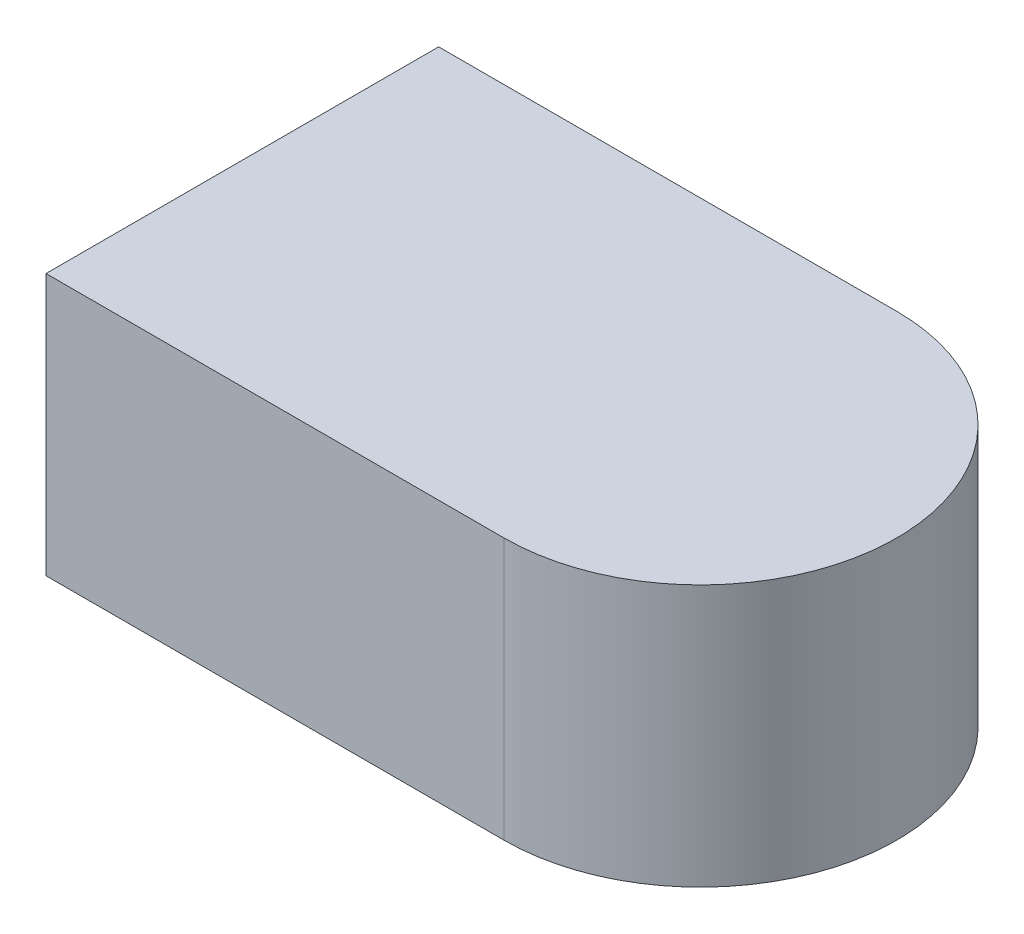
ISO-10303-21;
HEADER;
FILE_DESCRIPTION(('STEP AP214'),'2;1');
FILE_NAME('part.step','',(''),(''),'','','');
FILE_SCHEMA(('AUTOMOTIVE_DESIGN { 1 0 10303 214 1 1 1 1 }'));
ENDSEC;
DATA;
#1=APPLICATION_CONTEXT('core data for automotive mechanical design processes');
#2=APPLICATION_PROTOCOL_DEFINITION('international standard','automotive_design',2000,#1);
#3=PRODUCT_CONTEXT('',#1,'mechanical');
#4=PRODUCT('Part','Part','',(#3));
#5=PRODUCT_RELATED_PRODUCT_CATEGORY('part','',(#4));
#6=PRODUCT_DEFINITION_FORMATION('','',#4);
#7=PRODUCT_DEFINITION_CONTEXT('part definition',#1,'design');
#8=PRODUCT_DEFINITION('design','',#6,#7);
#9=PRODUCT_DEFINITION_SHAPE('','',#8);
#10=(LENGTH_UNIT() NAMED_UNIT(*) SI_UNIT(.MILLI.,.METRE.));
#11=(NAMED_UNIT(*) PLANE_ANGLE_UNIT() SI_UNIT($,.RADIAN.));
#12=(NAMED_UNIT(*) SI_UNIT($,.STERADIAN.) SOLID_ANGLE_UNIT());
#13=UNCERTAINTY_MEASURE_WITH_UNIT(LENGTH_MEASURE(1.E-05),#10,'distance_accuracy_value','');
#14=(GEOMETRIC_REPRESENTATION_CONTEXT(3) GLOBAL_UNCERTAINTY_ASSIGNED_CONTEXT((#13)) GLOBAL_UNIT_ASSIGNED_CONTEXT((#10,
#11,#12)) REPRESENTATION_CONTEXT('',''));
#15=CARTESIAN_POINT('',(0.,0.,0.));
#16=DIRECTION('',(0.,0.,1.));
#17=DIRECTION('',(1.,0.,0.));
#18=AXIS2_PLACEMENT_3D('',#15,#16,#17);
#19=CARTESIAN_POINT('',(0.175,0.2,0.));
#20=DIRECTION('',(0.,-1.,0.));
#21=DIRECTION('',(0.,0.,-1.));
#22=AXIS2_PLACEMENT_3D('',#19,#20,#21);
#23=CYLINDRICAL_SURFACE('',#22,0.15);
#24=CARTESIAN_POINT('',(0.175,0.,0.));
#25=DIRECTION('',(0.,1.,0.));
#26=DIRECTION('',(0.,0.,-1.));
#27=AXIS2_PLACEMENT_3D('',#24,#25,#26);
#28=CIRCLE('',#27,0.15);
#29=CARTESIAN_POINT('',(0.175,0.,0.15));
#30=VERTEX_POINT('',#29);
#31=CARTESIAN_POINT('',(0.175,0.,-0.15));
#32=VERTEX_POINT('',#31);
#33=EDGE_CURVE('E96',#30,#32,#28,.T.);
#34=ORIENTED_EDGE('',*,*,#33,.T.);
#35=DIRECTION('',(0.,-1.,0.));
#36=VECTOR('',#35,1.);
#37=CARTESIAN_POINT('',(0.175,0.2,-0.15));
#38=LINE('',#37,#36);
#39=CARTESIAN_POINT('',(0.175,0.2,-0.15));
#40=VERTEX_POINT('',#39);
#41=EDGE_CURVE('E11',#40,#32,#38,.T.);
#42=ORIENTED_EDGE('',*,*,#41,.F.);
#43=CARTESIAN_POINT('',(0.175,0.2,0.));
#44=DIRECTION('',(0.,1.,0.));
#45=DIRECTION('',(0.,0.,-1.));
#46=AXIS2_PLACEMENT_3D('',#43,#44,#45);
#47=CIRCLE('',#46,0.15);
#48=CARTESIAN_POINT('',(0.175,0.2,0.15));
#49=VERTEX_POINT('',#48);
#50=EDGE_CURVE('E84',#49,#40,#47,.T.);
#51=ORIENTED_EDGE('',*,*,#50,.F.);
#52=DIRECTION('',(0.,-1.,0.));
#53=VECTOR('',#52,1.);
#54=CARTESIAN_POINT('',(0.175,0.2,0.15));
#55=LINE('',#54,#53);
#56=EDGE_CURVE('E92',#49,#30,#55,.T.);
#57=ORIENTED_EDGE('',*,*,#56,.T.);
#58=EDGE_LOOP('',(#34,#42,#51,#57));
#59=FACE_BOUND('',#58,.T.);
#60=ADVANCED_FACE('F33',(#59),#23,.T.);
#61=CARTESIAN_POINT('',(-0.175,0.2,-0.15));
#62=DIRECTION('',(0.,0.,1.));
#63=DIRECTION('',(1.,0.,0.));
#64=AXIS2_PLACEMENT_3D('',#61,#62,#63);
#65=PLANE('',#64);
#66=DIRECTION('',(-1.,0.,0.));
#67=VECTOR('',#66,1.);
#68=CARTESIAN_POINT('',(-0.175,0.,-0.15));
#69=LINE('',#68,#67);
#70=CARTESIAN_POINT('',(-0.175,0.,-0.15));
#71=VERTEX_POINT('',#70);
#72=EDGE_CURVE('E88',#32,#71,#69,.T.);
#73=ORIENTED_EDGE('',*,*,#72,.T.);
#74=DIRECTION('',(0.,-1.,0.));
#75=VECTOR('',#74,1.);
#76=CARTESIAN_POINT('',(-0.175,0.2,-0.15));
#77=LINE('',#76,#75);
#78=CARTESIAN_POINT('',(-0.175,0.2,-0.15));
#79=VERTEX_POINT('',#78);
#80=EDGE_CURVE('E41',#79,#71,#77,.T.);
#81=ORIENTED_EDGE('',*,*,#80,.F.);
#82=DIRECTION('',(-1.,0.,0.));
#83=VECTOR('',#82,1.);
#84=CARTESIAN_POINT('',(-0.175,0.2,-0.15));
#85=LINE('',#84,#83);
#86=EDGE_CURVE('E79',#40,#79,#85,.T.);
#87=ORIENTED_EDGE('',*,*,#86,.F.);
#88=ORIENTED_EDGE('',*,*,#41,.T.);
#89=EDGE_LOOP('',(#73,#81,#87,#88));
#90=FACE_BOUND('',#89,.T.);
#91=ADVANCED_FACE('F87',(#90),#65,.F.);
#92=CARTESIAN_POINT('',(-0.175,0.2,0.15));
#93=DIRECTION('',(1.,0.,0.));
#94=DIRECTION('',(0.,0.,-1.));
#95=AXIS2_PLACEMENT_3D('',#92,#93,#94);
#96=PLANE('',#95);
#97=DIRECTION('',(0.,0.,1.));
#98=VECTOR('',#97,1.);
#99=CARTESIAN_POINT('',(-0.175,0.,0.15));
#100=LINE('',#99,#98);
#101=CARTESIAN_POINT('',(-0.175,0.,0.15));
#102=VERTEX_POINT('',#101);
#103=EDGE_CURVE('E66',#71,#102,#100,.T.);
#104=ORIENTED_EDGE('',*,*,#103,.T.);
#105=DIRECTION('',(0.,-1.,0.));
#106=VECTOR('',#105,1.);
#107=CARTESIAN_POINT('',(-0.175,0.2,0.15));
#108=LINE('',#107,#106);
#109=CARTESIAN_POINT('',(-0.175,0.2,0.15));
#110=VERTEX_POINT('',#109);
#111=EDGE_CURVE('E89',#110,#102,#108,.T.);
#112=ORIENTED_EDGE('',*,*,#111,.F.);
#113=DIRECTION('',(0.,0.,1.));
#114=VECTOR('',#113,1.);
#115=CARTESIAN_POINT('',(-0.175,0.2,0.15));
#116=LINE('',#115,#114);
#117=EDGE_CURVE('E82',#79,#110,#116,.T.);
#118=ORIENTED_EDGE('',*,*,#117,.F.);
#119=ORIENTED_EDGE('',*,*,#80,.T.);
#120=EDGE_LOOP('',(#104,#112,#118,#119));
#121=FACE_BOUND('',#120,.T.);
#122=ADVANCED_FACE('F90',(#121),#96,.F.);
#123=CARTESIAN_POINT('',(-0.175,0.2,0.15));
#124=DIRECTION('',(0.,0.,-1.));
#125=DIRECTION('',(-1.,0.,0.));
#126=AXIS2_PLACEMENT_3D('',#123,#124,#125);
#127=PLANE('',#126);
#128=DIRECTION('',(1.,0.,0.));
#129=VECTOR('',#128,1.);
#130=CARTESIAN_POINT('',(-0.175,0.,0.15));
#131=LINE('',#130,#129);
#132=EDGE_CURVE('E72',#102,#30,#131,.T.);
#133=ORIENTED_EDGE('',*,*,#132,.T.);
#134=ORIENTED_EDGE('',*,*,#56,.F.);
#135=DIRECTION('',(1.,0.,0.));
#136=VECTOR('',#135,1.);
#137=CARTESIAN_POINT('',(-0.175,0.2,0.15));
#138=LINE('',#137,#136);
#139=EDGE_CURVE('E49',#110,#49,#138,.T.);
#140=ORIENTED_EDGE('',*,*,#139,.F.);
#141=ORIENTED_EDGE('',*,*,#111,.T.);
#142=EDGE_LOOP('',(#133,#134,#140,#141));
#143=FACE_BOUND('',#142,.T.);
#144=ADVANCED_FACE('F103',(#143),#127,.F.);
#145=CARTESIAN_POINT('',(0.175,0.2,0.));
#146=DIRECTION('',(0.,-1.,0.));
#147=DIRECTION('',(0.,0.,-1.));
#148=AXIS2_PLACEMENT_3D('',#145,#146,#147);
#149=PLANE('',#148);
#150=ORIENTED_EDGE('',*,*,#50,.T.);
#151=ORIENTED_EDGE('',*,*,#86,.T.);
#152=ORIENTED_EDGE('',*,*,#117,.T.);
#153=ORIENTED_EDGE('',*,*,#139,.T.);
#154=EDGE_LOOP('',(#150,#151,#152,#153));
#155=FACE_BOUND('',#154,.T.);
#156=ADVANCED_FACE('F80',(#155),#149,.F.);
#157=CARTESIAN_POINT('',(0.175,0.,0.));
#158=DIRECTION('',(0.,-1.,0.));
#159=DIRECTION('',(0.,0.,-1.));
#160=AXIS2_PLACEMENT_3D('',#157,#158,#159);
#161=PLANE('',#160);
#162=ORIENTED_EDGE('',*,*,#33,.F.);
#163=ORIENTED_EDGE('',*,*,#132,.F.);
#164=ORIENTED_EDGE('',*,*,#103,.F.);
#165=ORIENTED_EDGE('',*,*,#72,.F.);
#166=EDGE_LOOP('',(#162,#163,#164,#165));
#167=FACE_BOUND('',#166,.T.);
#168=ADVANCED_FACE('F106',(#167),#161,.T.);
#169=CLOSED_SHELL('',(#60,#91,#122,#144,#156,#168));
#170=MANIFOLD_SOLID_BREP('B2',#169);
#171=ADVANCED_BREP_SHAPE_REPRESENTATION('',(#18,#170),#14);
#172=SHAPE_DEFINITION_REPRESENTATION(#9,#171);
ENDSEC;
END-ISO-10303-21;
